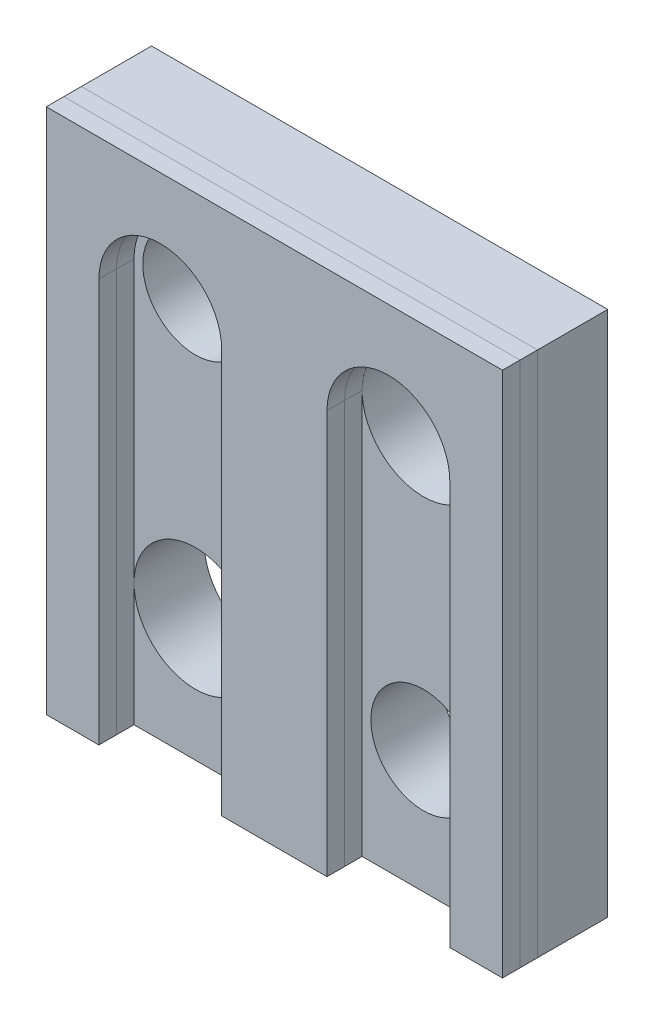
ISO-10303-21;
HEADER;
FILE_DESCRIPTION(('STEP AP214'),'2;1');
FILE_NAME('part.step','',(''),(''),'','','');
FILE_SCHEMA(('AUTOMOTIVE_DESIGN { 1 0 10303 214 1 1 1 1 }'));
ENDSEC;
DATA;
#1=APPLICATION_CONTEXT('core data for automotive mechanical design processes');
#2=APPLICATION_PROTOCOL_DEFINITION('international standard','automotive_design',2000,#1);
#3=PRODUCT_CONTEXT('',#1,'mechanical');
#4=PRODUCT('Part','Part','',(#3));
#5=PRODUCT_RELATED_PRODUCT_CATEGORY('part','',(#4));
#6=PRODUCT_DEFINITION_FORMATION('','',#4);
#7=PRODUCT_DEFINITION_CONTEXT('part definition',#1,'design');
#8=PRODUCT_DEFINITION('design','',#6,#7);
#9=PRODUCT_DEFINITION_SHAPE('','',#8);
#10=(LENGTH_UNIT() NAMED_UNIT(*) SI_UNIT(.MILLI.,.METRE.));
#11=(NAMED_UNIT(*) PLANE_ANGLE_UNIT() SI_UNIT($,.RADIAN.));
#12=(NAMED_UNIT(*) SI_UNIT($,.STERADIAN.) SOLID_ANGLE_UNIT());
#13=UNCERTAINTY_MEASURE_WITH_UNIT(LENGTH_MEASURE(1.E-05),#10,'distance_accuracy_value','');
#14=(GEOMETRIC_REPRESENTATION_CONTEXT(3) GLOBAL_UNCERTAINTY_ASSIGNED_CONTEXT((#13)) GLOBAL_UNIT_ASSIGNED_CONTEXT((#10,
#11,#12)) REPRESENTATION_CONTEXT('',''));
#15=CARTESIAN_POINT('',(0.,0.,0.));
#16=DIRECTION('',(0.,0.,1.));
#17=DIRECTION('',(1.,0.,0.));
#18=AXIS2_PLACEMENT_3D('',#15,#16,#17);
#19=CARTESIAN_POINT('',(-13.,-15.01,5.));
#20=DIRECTION('',(0.,0.,1.));
#21=DIRECTION('',(1.,0.,0.));
#22=AXIS2_PLACEMENT_3D('',#19,#20,#21);
#23=PLANE('',#22);
#24=DIRECTION('',(0.,-1.,0.));
#25=VECTOR('',#24,1.);
#26=CARTESIAN_POINT('',(10.,8.,5.));
#27=LINE('',#26,#25);
#28=CARTESIAN_POINT('',(10.,8.,5.));
#29=VERTEX_POINT('',#28);
#30=CARTESIAN_POINT('',(9.99999999999999,-15.,5.));
#31=VERTEX_POINT('',#30);
#32=EDGE_CURVE('E137',#29,#31,#27,.T.);
#33=ORIENTED_EDGE('',*,*,#32,.T.);
#34=DIRECTION('',(1.,0.,0.));
#35=VECTOR('',#34,1.);
#36=CARTESIAN_POINT('',(9.99999999999999,-15.,5.));
#37=LINE('',#36,#35);
#38=CARTESIAN_POINT('',(13.,-15.,5.));
#39=VERTEX_POINT('',#38);
#40=EDGE_CURVE('E144',#31,#39,#37,.T.);
#41=ORIENTED_EDGE('',*,*,#40,.T.);
#42=DIRECTION('',(0.,1.,0.));
#43=VECTOR('',#42,1.);
#44=CARTESIAN_POINT('',(13.,-15.,5.));
#45=LINE('',#44,#43);
#46=CARTESIAN_POINT('',(13.,15.,5.));
#47=VERTEX_POINT('',#46);
#48=EDGE_CURVE('E148',#39,#47,#45,.T.);
#49=ORIENTED_EDGE('',*,*,#48,.T.);
#50=DIRECTION('',(-1.,0.,0.));
#51=VECTOR('',#50,1.);
#52=CARTESIAN_POINT('',(13.,15.,5.));
#53=LINE('',#52,#51);
#54=CARTESIAN_POINT('',(-13.,15.,5.));
#55=VERTEX_POINT('',#54);
#56=EDGE_CURVE('E212',#47,#55,#53,.T.);
#57=ORIENTED_EDGE('',*,*,#56,.T.);
#58=DIRECTION('',(0.,-1.,0.));
#59=VECTOR('',#58,1.);
#60=CARTESIAN_POINT('',(-13.,15.,5.));
#61=LINE('',#60,#59);
#62=CARTESIAN_POINT('',(-13.,-15.,5.));
#63=VERTEX_POINT('',#62);
#64=EDGE_CURVE('E215',#55,#63,#61,.T.);
#65=ORIENTED_EDGE('',*,*,#64,.T.);
#66=DIRECTION('',(1.,0.,0.));
#67=VECTOR('',#66,1.);
#68=CARTESIAN_POINT('',(-13.,-15.,5.));
#69=LINE('',#68,#67);
#70=CARTESIAN_POINT('',(-9.99999999999999,-15.,5.));
#71=VERTEX_POINT('',#70);
#72=EDGE_CURVE('E218',#63,#71,#69,.T.);
#73=ORIENTED_EDGE('',*,*,#72,.T.);
#74=DIRECTION('',(0.,1.,0.));
#75=VECTOR('',#74,1.);
#76=CARTESIAN_POINT('',(-9.99999999999999,8.,5.));
#77=LINE('',#76,#75);
#78=CARTESIAN_POINT('',(-9.99999999999999,8.,5.));
#79=VERTEX_POINT('',#78);
#80=EDGE_CURVE('E221',#71,#79,#77,.T.);
#81=ORIENTED_EDGE('',*,*,#80,.T.);
#82=CARTESIAN_POINT('',(-6.5,8.,5.));
#83=DIRECTION('',(0.,0.,1.));
#84=DIRECTION('',(1.,0.,0.));
#85=AXIS2_PLACEMENT_3D('',#82,#83,#84);
#86=CIRCLE('',#85,3.5);
#87=CARTESIAN_POINT('',(-3.,8.,5.));
#88=VERTEX_POINT('',#87);
#89=EDGE_CURVE('E224',#79,#88,#86,.F.);
#90=ORIENTED_EDGE('',*,*,#89,.T.);
#91=DIRECTION('',(0.,-1.,0.));
#92=VECTOR('',#91,1.);
#93=CARTESIAN_POINT('',(-3.,8.,5.));
#94=LINE('',#93,#92);
#95=CARTESIAN_POINT('',(-3.,-15.,5.));
#96=VERTEX_POINT('',#95);
#97=EDGE_CURVE('E227',#88,#96,#94,.T.);
#98=ORIENTED_EDGE('',*,*,#97,.T.);
#99=DIRECTION('',(1.,0.,0.));
#100=VECTOR('',#99,1.);
#101=CARTESIAN_POINT('',(-3.,-15.,5.));
#102=LINE('',#101,#100);
#103=CARTESIAN_POINT('',(2.99999999999999,-15.,5.));
#104=VERTEX_POINT('',#103);
#105=EDGE_CURVE('E230',#96,#104,#102,.T.);
#106=ORIENTED_EDGE('',*,*,#105,.T.);
#107=DIRECTION('',(0.,1.,0.));
#108=VECTOR('',#107,1.);
#109=CARTESIAN_POINT('',(3.,8.,5.));
#110=LINE('',#109,#108);
#111=CARTESIAN_POINT('',(3.,8.,5.));
#112=VERTEX_POINT('',#111);
#113=EDGE_CURVE('E155',#104,#112,#110,.T.);
#114=ORIENTED_EDGE('',*,*,#113,.T.);
#115=CARTESIAN_POINT('',(6.5,8.,5.));
#116=DIRECTION('',(0.,0.,1.));
#117=DIRECTION('',(1.,0.,0.));
#118=AXIS2_PLACEMENT_3D('',#115,#116,#117);
#119=CIRCLE('',#118,3.5);
#120=EDGE_CURVE('E153',#112,#29,#119,.F.);
#121=ORIENTED_EDGE('',*,*,#120,.T.);
#122=EDGE_LOOP('',(#33,#41,#49,#57,#65,#73,#81,#90,#98,#106,#114,#121));
#123=FACE_BOUND('',#122,.T.);
#124=ADVANCED_FACE('F43',(#123),#23,.T.);
#125=CARTESIAN_POINT('',(9.99999999999999,-15.,6.));
#126=DIRECTION('',(0.,1.,0.));
#127=DIRECTION('',(-1.,0.,0.));
#128=AXIS2_PLACEMENT_3D('',#125,#126,#127);
#129=PLANE('',#128);
#130=ORIENTED_EDGE('',*,*,#40,.F.);
#131=DIRECTION('',(0.,0.,-1.));
#132=VECTOR('',#131,1.);
#133=CARTESIAN_POINT('',(9.99999999999999,-15.,6.));
#134=LINE('',#133,#132);
#135=CARTESIAN_POINT('',(9.99999999999999,-15.,4.));
#136=VERTEX_POINT('',#135);
#137=EDGE_CURVE('E47',#31,#136,#134,.T.);
#138=ORIENTED_EDGE('',*,*,#137,.T.);
#139=DIRECTION('',(1.,0.,0.));
#140=VECTOR('',#139,1.);
#141=CARTESIAN_POINT('',(9.99999999999999,-15.,4.));
#142=LINE('',#141,#140);
#143=CARTESIAN_POINT('',(13.,-15.,4.));
#144=VERTEX_POINT('',#143);
#145=EDGE_CURVE('E12',#136,#144,#142,.T.);
#146=ORIENTED_EDGE('',*,*,#145,.T.);
#147=DIRECTION('',(0.,0.,-1.));
#148=VECTOR('',#147,1.);
#149=CARTESIAN_POINT('',(13.,-15.,6.));
#150=LINE('',#149,#148);
#151=EDGE_CURVE('E60',#39,#144,#150,.T.);
#152=ORIENTED_EDGE('',*,*,#151,.F.);
#153=EDGE_LOOP('',(#130,#138,#146,#152));
#154=FACE_BOUND('',#153,.T.);
#155=ADVANCED_FACE('F145',(#154),#129,.F.);
#156=CARTESIAN_POINT('',(13.,-15.,6.));
#157=DIRECTION('',(-1.,0.,0.));
#158=DIRECTION('',(0.,0.,1.));
#159=AXIS2_PLACEMENT_3D('',#156,#157,#158);
#160=PLANE('',#159);
#161=ORIENTED_EDGE('',*,*,#48,.F.);
#162=ORIENTED_EDGE('',*,*,#151,.T.);
#163=DIRECTION('',(0.,1.,0.));
#164=VECTOR('',#163,1.);
#165=CARTESIAN_POINT('',(13.,-15.,4.));
#166=LINE('',#165,#164);
#167=CARTESIAN_POINT('',(13.,15.,4.));
#168=VERTEX_POINT('',#167);
#169=EDGE_CURVE('E52',#144,#168,#166,.T.);
#170=ORIENTED_EDGE('',*,*,#169,.T.);
#171=DIRECTION('',(0.,0.,-1.));
#172=VECTOR('',#171,1.);
#173=CARTESIAN_POINT('',(13.,15.,6.));
#174=LINE('',#173,#172);
#175=EDGE_CURVE('E68',#47,#168,#174,.T.);
#176=ORIENTED_EDGE('',*,*,#175,.F.);
#177=EDGE_LOOP('',(#161,#162,#170,#176));
#178=FACE_BOUND('',#177,.T.);
#179=ADVANCED_FACE('F261',(#178),#160,.F.);
#180=CARTESIAN_POINT('',(13.,15.,6.));
#181=DIRECTION('',(0.,-1.,0.));
#182=DIRECTION('',(0.,0.,-1.));
#183=AXIS2_PLACEMENT_3D('',#180,#181,#182);
#184=PLANE('',#183);
#185=ORIENTED_EDGE('',*,*,#56,.F.);
#186=ORIENTED_EDGE('',*,*,#175,.T.);
#187=DIRECTION('',(-1.,0.,0.));
#188=VECTOR('',#187,1.);
#189=CARTESIAN_POINT('',(13.,15.,4.));
#190=LINE('',#189,#188);
#191=CARTESIAN_POINT('',(-13.,15.,4.));
#192=VERTEX_POINT('',#191);
#193=EDGE_CURVE('E208',#168,#192,#190,.T.);
#194=ORIENTED_EDGE('',*,*,#193,.T.);
#195=DIRECTION('',(0.,0.,-1.));
#196=VECTOR('',#195,1.);
#197=CARTESIAN_POINT('',(-13.,15.,6.));
#198=LINE('',#197,#196);
#199=EDGE_CURVE('E161',#55,#192,#198,.T.);
#200=ORIENTED_EDGE('',*,*,#199,.F.);
#201=EDGE_LOOP('',(#185,#186,#194,#200));
#202=FACE_BOUND('',#201,.T.);
#203=ADVANCED_FACE('F260',(#202),#184,.F.);
#204=CARTESIAN_POINT('',(-13.,15.,6.));
#205=DIRECTION('',(1.,0.,0.));
#206=DIRECTION('',(0.,0.,-1.));
#207=AXIS2_PLACEMENT_3D('',#204,#205,#206);
#208=PLANE('',#207);
#209=ORIENTED_EDGE('',*,*,#64,.F.);
#210=ORIENTED_EDGE('',*,*,#199,.T.);
#211=DIRECTION('',(0.,-1.,0.));
#212=VECTOR('',#211,1.);
#213=CARTESIAN_POINT('',(-13.,15.,4.));
#214=LINE('',#213,#212);
#215=CARTESIAN_POINT('',(-13.,-15.,4.));
#216=VERTEX_POINT('',#215);
#217=EDGE_CURVE('E205',#192,#216,#214,.T.);
#218=ORIENTED_EDGE('',*,*,#217,.T.);
#219=DIRECTION('',(0.,0.,-1.));
#220=VECTOR('',#219,1.);
#221=CARTESIAN_POINT('',(-13.,-15.,6.));
#222=LINE('',#221,#220);
#223=EDGE_CURVE('E163',#63,#216,#222,.T.);
#224=ORIENTED_EDGE('',*,*,#223,.F.);
#225=EDGE_LOOP('',(#209,#210,#218,#224));
#226=FACE_BOUND('',#225,.T.);
#227=ADVANCED_FACE('F258',(#226),#208,.F.);
#228=CARTESIAN_POINT('',(-13.,-15.,6.));
#229=DIRECTION('',(0.,1.,0.));
#230=DIRECTION('',(-1.,0.,0.));
#231=AXIS2_PLACEMENT_3D('',#228,#229,#230);
#232=PLANE('',#231);
#233=ORIENTED_EDGE('',*,*,#72,.F.);
#234=ORIENTED_EDGE('',*,*,#223,.T.);
#235=DIRECTION('',(1.,0.,0.));
#236=VECTOR('',#235,1.);
#237=CARTESIAN_POINT('',(-13.,-15.,4.));
#238=LINE('',#237,#236);
#239=CARTESIAN_POINT('',(-9.99999999999999,-15.,4.));
#240=VERTEX_POINT('',#239);
#241=EDGE_CURVE('E202',#216,#240,#238,.T.);
#242=ORIENTED_EDGE('',*,*,#241,.T.);
#243=DIRECTION('',(0.,0.,-1.));
#244=VECTOR('',#243,1.);
#245=CARTESIAN_POINT('',(-9.99999999999999,-15.,6.));
#246=LINE('',#245,#244);
#247=EDGE_CURVE('E165',#71,#240,#246,.T.);
#248=ORIENTED_EDGE('',*,*,#247,.F.);
#249=EDGE_LOOP('',(#233,#234,#242,#248));
#250=FACE_BOUND('',#249,.T.);
#251=ADVANCED_FACE('F255',(#250),#232,.F.);
#252=CARTESIAN_POINT('',(-9.99999999999999,8.,6.));
#253=DIRECTION('',(-1.,0.,0.));
#254=DIRECTION('',(0.,0.,1.));
#255=AXIS2_PLACEMENT_3D('',#252,#253,#254);
#256=PLANE('',#255);
#257=ORIENTED_EDGE('',*,*,#80,.F.);
#258=ORIENTED_EDGE('',*,*,#247,.T.);
#259=DIRECTION('',(0.,1.,0.));
#260=VECTOR('',#259,1.);
#261=CARTESIAN_POINT('',(-9.99999999999999,8.,4.));
#262=LINE('',#261,#260);
#263=CARTESIAN_POINT('',(-9.99999999999999,8.,4.));
#264=VERTEX_POINT('',#263);
#265=EDGE_CURVE('E199',#240,#264,#262,.T.);
#266=ORIENTED_EDGE('',*,*,#265,.T.);
#267=DIRECTION('',(0.,0.,-1.));
#268=VECTOR('',#267,1.);
#269=CARTESIAN_POINT('',(-9.99999999999999,8.,6.));
#270=LINE('',#269,#268);
#271=EDGE_CURVE('E167',#79,#264,#270,.T.);
#272=ORIENTED_EDGE('',*,*,#271,.F.);
#273=EDGE_LOOP('',(#257,#258,#266,#272));
#274=FACE_BOUND('',#273,.T.);
#275=ADVANCED_FACE('F252',(#274),#256,.F.);
#276=CARTESIAN_POINT('',(-6.5,8.,6.));
#277=DIRECTION('',(0.,0.,-1.));
#278=DIRECTION('',(-1.,0.,0.));
#279=AXIS2_PLACEMENT_3D('',#276,#277,#278);
#280=CYLINDRICAL_SURFACE('',#279,3.5);
#281=ORIENTED_EDGE('',*,*,#89,.F.);
#282=ORIENTED_EDGE('',*,*,#271,.T.);
#283=CARTESIAN_POINT('',(-6.5,8.,4.));
#284=DIRECTION('',(0.,0.,-1.));
#285=DIRECTION('',(1.,0.,0.));
#286=AXIS2_PLACEMENT_3D('',#283,#284,#285);
#287=CIRCLE('',#286,3.5);
#288=CARTESIAN_POINT('',(-3.,8.,4.));
#289=VERTEX_POINT('',#288);
#290=EDGE_CURVE('E196',#264,#289,#287,.T.);
#291=ORIENTED_EDGE('',*,*,#290,.T.);
#292=DIRECTION('',(0.,0.,-1.));
#293=VECTOR('',#292,1.);
#294=CARTESIAN_POINT('',(-3.,8.,6.));
#295=LINE('',#294,#293);
#296=EDGE_CURVE('E169',#88,#289,#295,.T.);
#297=ORIENTED_EDGE('',*,*,#296,.F.);
#298=EDGE_LOOP('',(#281,#282,#291,#297));
#299=FACE_BOUND('',#298,.T.);
#300=ADVANCED_FACE('F246',(#299),#280,.F.);
#301=CARTESIAN_POINT('',(-3.,8.,6.));
#302=DIRECTION('',(1.,0.,0.));
#303=DIRECTION('',(0.,1.,0.));
#304=AXIS2_PLACEMENT_3D('',#301,#302,#303);
#305=PLANE('',#304);
#306=ORIENTED_EDGE('',*,*,#97,.F.);
#307=ORIENTED_EDGE('',*,*,#296,.T.);
#308=DIRECTION('',(0.,-1.,0.));
#309=VECTOR('',#308,1.);
#310=CARTESIAN_POINT('',(-3.,8.,4.));
#311=LINE('',#310,#309);
#312=CARTESIAN_POINT('',(-3.,-15.,4.));
#313=VERTEX_POINT('',#312);
#314=EDGE_CURVE('E193',#289,#313,#311,.T.);
#315=ORIENTED_EDGE('',*,*,#314,.T.);
#316=DIRECTION('',(0.,0.,-1.));
#317=VECTOR('',#316,1.);
#318=CARTESIAN_POINT('',(-3.,-15.,6.));
#319=LINE('',#318,#317);
#320=EDGE_CURVE('E171',#96,#313,#319,.T.);
#321=ORIENTED_EDGE('',*,*,#320,.F.);
#322=EDGE_LOOP('',(#306,#307,#315,#321));
#323=FACE_BOUND('',#322,.T.);
#324=ADVANCED_FACE('F243',(#323),#305,.F.);
#325=CARTESIAN_POINT('',(-3.,-15.,6.));
#326=DIRECTION('',(0.,1.,0.));
#327=DIRECTION('',(0.,0.,1.));
#328=AXIS2_PLACEMENT_3D('',#325,#326,#327);
#329=PLANE('',#328);
#330=ORIENTED_EDGE('',*,*,#105,.F.);
#331=ORIENTED_EDGE('',*,*,#320,.T.);
#332=DIRECTION('',(1.,0.,0.));
#333=VECTOR('',#332,1.);
#334=CARTESIAN_POINT('',(-3.,-15.,4.));
#335=LINE('',#334,#333);
#336=CARTESIAN_POINT('',(2.99999999999999,-15.,4.));
#337=VERTEX_POINT('',#336);
#338=EDGE_CURVE('E190',#313,#337,#335,.T.);
#339=ORIENTED_EDGE('',*,*,#338,.T.);
#340=DIRECTION('',(0.,0.,-1.));
#341=VECTOR('',#340,1.);
#342=CARTESIAN_POINT('',(2.99999999999999,-15.,6.));
#343=LINE('',#342,#341);
#344=EDGE_CURVE('E173',#104,#337,#343,.T.);
#345=ORIENTED_EDGE('',*,*,#344,.F.);
#346=EDGE_LOOP('',(#330,#331,#339,#345));
#347=FACE_BOUND('',#346,.T.);
#348=ADVANCED_FACE('F240',(#347),#329,.F.);
#349=CARTESIAN_POINT('',(3.,8.,6.));
#350=DIRECTION('',(-1.,0.,0.));
#351=DIRECTION('',(0.,-1.,0.));
#352=AXIS2_PLACEMENT_3D('',#349,#350,#351);
#353=PLANE('',#352);
#354=ORIENTED_EDGE('',*,*,#113,.F.);
#355=ORIENTED_EDGE('',*,*,#344,.T.);
#356=DIRECTION('',(0.,1.,0.));
#357=VECTOR('',#356,1.);
#358=CARTESIAN_POINT('',(3.,8.,4.));
#359=LINE('',#358,#357);
#360=CARTESIAN_POINT('',(3.,8.,4.));
#361=VERTEX_POINT('',#360);
#362=EDGE_CURVE('E184',#337,#361,#359,.T.);
#363=ORIENTED_EDGE('',*,*,#362,.T.);
#364=DIRECTION('',(0.,0.,-1.));
#365=VECTOR('',#364,1.);
#366=CARTESIAN_POINT('',(3.,8.,6.));
#367=LINE('',#366,#365);
#368=EDGE_CURVE('E175',#112,#361,#367,.T.);
#369=ORIENTED_EDGE('',*,*,#368,.F.);
#370=EDGE_LOOP('',(#354,#355,#363,#369));
#371=FACE_BOUND('',#370,.T.);
#372=ADVANCED_FACE('F235',(#371),#353,.F.);
#373=CARTESIAN_POINT('',(6.5,8.,6.));
#374=DIRECTION('',(0.,0.,-1.));
#375=DIRECTION('',(-1.,0.,0.));
#376=AXIS2_PLACEMENT_3D('',#373,#374,#375);
#377=CYLINDRICAL_SURFACE('',#376,3.5);
#378=ORIENTED_EDGE('',*,*,#120,.F.);
#379=ORIENTED_EDGE('',*,*,#368,.T.);
#380=CARTESIAN_POINT('',(6.5,8.,4.));
#381=DIRECTION('',(0.,0.,-1.));
#382=DIRECTION('',(1.,0.,0.));
#383=AXIS2_PLACEMENT_3D('',#380,#381,#382);
#384=CIRCLE('',#383,3.5);
#385=CARTESIAN_POINT('',(10.,8.,4.));
#386=VERTEX_POINT('',#385);
#387=EDGE_CURVE('E179',#361,#386,#384,.T.);
#388=ORIENTED_EDGE('',*,*,#387,.T.);
#389=DIRECTION('',(0.,0.,-1.));
#390=VECTOR('',#389,1.);
#391=CARTESIAN_POINT('',(10.,8.,6.));
#392=LINE('',#391,#390);
#393=EDGE_CURVE('E142',#29,#386,#392,.T.);
#394=ORIENTED_EDGE('',*,*,#393,.F.);
#395=EDGE_LOOP('',(#378,#379,#388,#394));
#396=FACE_BOUND('',#395,.T.);
#397=ADVANCED_FACE('F180',(#396),#377,.F.);
#398=CARTESIAN_POINT('',(10.,8.,6.));
#399=DIRECTION('',(1.,0.,0.));
#400=DIRECTION('',(0.,1.,0.));
#401=AXIS2_PLACEMENT_3D('',#398,#399,#400);
#402=PLANE('',#401);
#403=ORIENTED_EDGE('',*,*,#32,.F.);
#404=ORIENTED_EDGE('',*,*,#393,.T.);
#405=DIRECTION('',(0.,-1.,0.));
#406=VECTOR('',#405,1.);
#407=CARTESIAN_POINT('',(10.,8.,4.));
#408=LINE('',#407,#406);
#409=EDGE_CURVE('E139',#386,#136,#408,.T.);
#410=ORIENTED_EDGE('',*,*,#409,.T.);
#411=ORIENTED_EDGE('',*,*,#137,.F.);
#412=EDGE_LOOP('',(#403,#404,#410,#411));
#413=FACE_BOUND('',#412,.T.);
#414=ADVANCED_FACE('F45',(#413),#402,.F.);
#415=CARTESIAN_POINT('',(-6.5,8.,4.));
#416=DIRECTION('',(0.,0.,1.));
#417=DIRECTION('',(1.,0.,0.));
#418=AXIS2_PLACEMENT_3D('',#415,#416,#417);
#419=PLANE('',#418);
#420=ORIENTED_EDGE('',*,*,#145,.F.);
#421=ORIENTED_EDGE('',*,*,#409,.F.);
#422=ORIENTED_EDGE('',*,*,#387,.F.);
#423=ORIENTED_EDGE('',*,*,#362,.F.);
#424=ORIENTED_EDGE('',*,*,#338,.F.);
#425=ORIENTED_EDGE('',*,*,#314,.F.);
#426=ORIENTED_EDGE('',*,*,#290,.F.);
#427=ORIENTED_EDGE('',*,*,#265,.F.);
#428=ORIENTED_EDGE('',*,*,#241,.F.);
#429=ORIENTED_EDGE('',*,*,#217,.F.);
#430=ORIENTED_EDGE('',*,*,#193,.F.);
#431=ORIENTED_EDGE('',*,*,#169,.F.);
#432=EDGE_LOOP('',(#420,#421,#422,#423,#424,#425,#426,#427,#428,#429,#430,#431));
#433=FACE_BOUND('',#432,.T.);
#434=ADVANCED_FACE('F186',(#433),#419,.F.);
#435=CLOSED_SHELL('',(#124,#155,#179,#203,#227,#251,#275,#300,#324,#348,#372,#397,#414,#434));
#436=MANIFOLD_SOLID_BREP('B2',#435);
#437=CARTESIAN_POINT('',(-13.,-15.01,5.));
#438=DIRECTION('',(0.,0.,1.));
#439=DIRECTION('',(1.,0.,0.));
#440=AXIS2_PLACEMENT_3D('',#437,#438,#439);
#441=PLANE('',#440);
#442=DIRECTION('',(0.,-1.,0.));
#443=VECTOR('',#442,1.);
#444=CARTESIAN_POINT('',(10.,8.,5.));
#445=LINE('',#444,#443);
#446=CARTESIAN_POINT('',(10.,8.,5.));
#447=VERTEX_POINT('',#446);
#448=CARTESIAN_POINT('',(9.99999999999999,-15.,5.));
#449=VERTEX_POINT('',#448);
#450=EDGE_CURVE('E485',#447,#449,#445,.T.);
#451=ORIENTED_EDGE('',*,*,#450,.F.);
#452=CARTESIAN_POINT('',(6.5,8.,5.));
#453=DIRECTION('',(0.,0.,1.));
#454=DIRECTION('',(1.,0.,0.));
#455=AXIS2_PLACEMENT_3D('',#452,#453,#454);
#456=CIRCLE('',#455,3.5);
#457=CARTESIAN_POINT('',(3.,8.,5.));
#458=VERTEX_POINT('',#457);
#459=EDGE_CURVE('E488',#458,#447,#456,.F.);
#460=ORIENTED_EDGE('',*,*,#459,.F.);
#461=DIRECTION('',(0.,1.,0.));
#462=VECTOR('',#461,1.);
#463=CARTESIAN_POINT('',(3.,8.,5.));
#464=LINE('',#463,#462);
#465=CARTESIAN_POINT('',(2.99999999999999,-15.,5.));
#466=VERTEX_POINT('',#465);
#467=EDGE_CURVE('E501',#466,#458,#464,.T.);
#468=ORIENTED_EDGE('',*,*,#467,.F.);
#469=DIRECTION('',(1.,0.,0.));
#470=VECTOR('',#469,1.);
#471=CARTESIAN_POINT('',(-3.,-15.,5.));
#472=LINE('',#471,#470);
#473=CARTESIAN_POINT('',(-3.,-15.,5.));
#474=VERTEX_POINT('',#473);
#475=EDGE_CURVE('E503',#474,#466,#472,.T.);
#476=ORIENTED_EDGE('',*,*,#475,.F.);
#477=DIRECTION('',(0.,-1.,0.));
#478=VECTOR('',#477,1.);
#479=CARTESIAN_POINT('',(-3.,8.,5.));
#480=LINE('',#479,#478);
#481=CARTESIAN_POINT('',(-3.,8.,5.));
#482=VERTEX_POINT('',#481);
#483=EDGE_CURVE('E505',#482,#474,#480,.T.);
#484=ORIENTED_EDGE('',*,*,#483,.F.);
#485=CARTESIAN_POINT('',(-6.5,8.,5.));
#486=DIRECTION('',(0.,0.,1.));
#487=DIRECTION('',(1.,0.,0.));
#488=AXIS2_PLACEMENT_3D('',#485,#486,#487);
#489=CIRCLE('',#488,3.5);
#490=CARTESIAN_POINT('',(-9.99999999999999,8.,5.));
#491=VERTEX_POINT('',#490);
#492=EDGE_CURVE('E507',#491,#482,#489,.F.);
#493=ORIENTED_EDGE('',*,*,#492,.F.);
#494=DIRECTION('',(0.,1.,0.));
#495=VECTOR('',#494,1.);
#496=CARTESIAN_POINT('',(-9.99999999999999,8.,5.));
#497=LINE('',#496,#495);
#498=CARTESIAN_POINT('',(-9.99999999999999,-15.,5.));
#499=VERTEX_POINT('',#498);
#500=EDGE_CURVE('E509',#499,#491,#497,.T.);
#501=ORIENTED_EDGE('',*,*,#500,.F.);
#502=DIRECTION('',(1.,0.,0.));
#503=VECTOR('',#502,1.);
#504=CARTESIAN_POINT('',(-13.,-15.,5.));
#505=LINE('',#504,#503);
#506=CARTESIAN_POINT('',(-13.,-15.,5.));
#507=VERTEX_POINT('',#506);
#508=EDGE_CURVE('E497',#507,#499,#505,.T.);
#509=ORIENTED_EDGE('',*,*,#508,.F.);
#510=DIRECTION('',(0.,-1.,0.));
#511=VECTOR('',#510,1.);
#512=CARTESIAN_POINT('',(-13.,15.,5.));
#513=LINE('',#512,#511);
#514=CARTESIAN_POINT('',(-13.,15.,5.));
#515=VERTEX_POINT('',#514);
#516=EDGE_CURVE('E494',#515,#507,#513,.T.);
#517=ORIENTED_EDGE('',*,*,#516,.F.);
#518=DIRECTION('',(-1.,0.,0.));
#519=VECTOR('',#518,1.);
#520=CARTESIAN_POINT('',(13.,15.,5.));
#521=LINE('',#520,#519);
#522=CARTESIAN_POINT('',(13.,15.,5.));
#523=VERTEX_POINT('',#522);
#524=EDGE_CURVE('E496',#523,#515,#521,.T.);
#525=ORIENTED_EDGE('',*,*,#524,.F.);
#526=DIRECTION('',(0.,1.,0.));
#527=VECTOR('',#526,1.);
#528=CARTESIAN_POINT('',(13.,-15.,5.));
#529=LINE('',#528,#527);
#530=CARTESIAN_POINT('',(13.,-15.,5.));
#531=VERTEX_POINT('',#530);
#532=EDGE_CURVE('E390',#531,#523,#529,.T.);
#533=ORIENTED_EDGE('',*,*,#532,.F.);
#534=DIRECTION('',(1.,0.,0.));
#535=VECTOR('',#534,1.);
#536=CARTESIAN_POINT('',(9.99999999999999,-15.,5.));
#537=LINE('',#536,#535);
#538=EDGE_CURVE('E41',#449,#531,#537,.T.);
#539=ORIENTED_EDGE('',*,*,#538,.F.);
#540=EDGE_LOOP('',(#451,#460,#468,#476,#484,#493,#501,#509,#517,#525,#533,#539));
#541=FACE_BOUND('',#540,.T.);
#542=ADVANCED_FACE('F383',(#541),#441,.F.);
#543=CARTESIAN_POINT('',(13.,-15.,6.));
#544=DIRECTION('',(-1.,0.,0.));
#545=DIRECTION('',(0.,0.,1.));
#546=AXIS2_PLACEMENT_3D('',#543,#544,#545);
#547=PLANE('',#546);
#548=DIRECTION('',(0.,0.,-1.));
#549=VECTOR('',#548,1.);
#550=CARTESIAN_POINT('',(13.,-15.,6.));
#551=LINE('',#550,#549);
#552=CARTESIAN_POINT('',(13.,-15.,6.));
#553=VERTEX_POINT('',#552);
#554=EDGE_CURVE('E470',#553,#531,#551,.T.);
#555=ORIENTED_EDGE('',*,*,#554,.T.);
#556=ORIENTED_EDGE('',*,*,#532,.T.);
#557=DIRECTION('',(0.,0.,-1.));
#558=VECTOR('',#557,1.);
#559=CARTESIAN_POINT('',(13.,15.,6.));
#560=LINE('',#559,#558);
#561=CARTESIAN_POINT('',(13.,15.,6.));
#562=VERTEX_POINT('',#561);
#563=EDGE_CURVE('E472',#562,#523,#560,.T.);
#564=ORIENTED_EDGE('',*,*,#563,.F.);
#565=DIRECTION('',(0.,1.,0.));
#566=VECTOR('',#565,1.);
#567=CARTESIAN_POINT('',(13.,-15.,6.));
#568=LINE('',#567,#566);
#569=EDGE_CURVE('E467',#553,#562,#568,.T.);
#570=ORIENTED_EDGE('',*,*,#569,.F.);
#571=EDGE_LOOP('',(#555,#556,#564,#570));
#572=FACE_BOUND('',#571,.T.);
#573=ADVANCED_FACE('F469',(#572),#547,.F.);
#574=CARTESIAN_POINT('',(13.,15.,6.));
#575=DIRECTION('',(0.,-1.,0.));
#576=DIRECTION('',(0.,0.,-1.));
#577=AXIS2_PLACEMENT_3D('',#574,#575,#576);
#578=PLANE('',#577);
#579=ORIENTED_EDGE('',*,*,#563,.T.);
#580=ORIENTED_EDGE('',*,*,#524,.T.);
#581=DIRECTION('',(0.,0.,-1.));
#582=VECTOR('',#581,1.);
#583=CARTESIAN_POINT('',(-13.,15.,6.));
#584=LINE('',#583,#582);
#585=CARTESIAN_POINT('',(-13.,15.,6.));
#586=VERTEX_POINT('',#585);
#587=EDGE_CURVE('E490',#586,#515,#584,.T.);
#588=ORIENTED_EDGE('',*,*,#587,.F.);
#589=DIRECTION('',(-1.,0.,0.));
#590=VECTOR('',#589,1.);
#591=CARTESIAN_POINT('',(13.,15.,6.));
#592=LINE('',#591,#590);
#593=EDGE_CURVE('E475',#562,#586,#592,.T.);
#594=ORIENTED_EDGE('',*,*,#593,.F.);
#595=EDGE_LOOP('',(#579,#580,#588,#594));
#596=FACE_BOUND('',#595,.T.);
#597=ADVANCED_FACE('F545',(#596),#578,.F.);
#598=CARTESIAN_POINT('',(-13.,15.,6.));
#599=DIRECTION('',(1.,0.,0.));
#600=DIRECTION('',(0.,0.,-1.));
#601=AXIS2_PLACEMENT_3D('',#598,#599,#600);
#602=PLANE('',#601);
#603=ORIENTED_EDGE('',*,*,#587,.T.);
#604=ORIENTED_EDGE('',*,*,#516,.T.);
#605=DIRECTION('',(0.,0.,-1.));
#606=VECTOR('',#605,1.);
#607=CARTESIAN_POINT('',(-13.,-15.,6.));
#608=LINE('',#607,#606);
#609=CARTESIAN_POINT('',(-13.,-15.,6.));
#610=VERTEX_POINT('',#609);
#611=EDGE_CURVE('E521',#610,#507,#608,.T.);
#612=ORIENTED_EDGE('',*,*,#611,.F.);
#613=DIRECTION('',(0.,-1.,0.));
#614=VECTOR('',#613,1.);
#615=CARTESIAN_POINT('',(-13.,15.,6.));
#616=LINE('',#615,#614);
#617=EDGE_CURVE('E543',#586,#610,#616,.T.);
#618=ORIENTED_EDGE('',*,*,#617,.F.);
#619=EDGE_LOOP('',(#603,#604,#612,#618));
#620=FACE_BOUND('',#619,.T.);
#621=ADVANCED_FACE('F542',(#620),#602,.F.);
#622=CARTESIAN_POINT('',(-13.,-15.,6.));
#623=DIRECTION('',(0.,1.,0.));
#624=DIRECTION('',(-1.,0.,0.));
#625=AXIS2_PLACEMENT_3D('',#622,#623,#624);
#626=PLANE('',#625);
#627=ORIENTED_EDGE('',*,*,#611,.T.);
#628=ORIENTED_EDGE('',*,*,#508,.T.);
#629=DIRECTION('',(0.,0.,-1.));
#630=VECTOR('',#629,1.);
#631=CARTESIAN_POINT('',(-9.99999999999999,-15.,6.));
#632=LINE('',#631,#630);
#633=CARTESIAN_POINT('',(-9.99999999999999,-15.,6.));
#634=VERTEX_POINT('',#633);
#635=EDGE_CURVE('E518',#634,#499,#632,.T.);
#636=ORIENTED_EDGE('',*,*,#635,.F.);
#637=DIRECTION('',(1.,0.,0.));
#638=VECTOR('',#637,1.);
#639=CARTESIAN_POINT('',(-13.,-15.,6.));
#640=LINE('',#639,#638);
#641=EDGE_CURVE('E709',#610,#634,#640,.T.);
#642=ORIENTED_EDGE('',*,*,#641,.F.);
#643=EDGE_LOOP('',(#627,#628,#636,#642));
#644=FACE_BOUND('',#643,.T.);
#645=ADVANCED_FACE('F515',(#644),#626,.F.);
#646=CARTESIAN_POINT('',(-9.99999999999999,8.,6.));
#647=DIRECTION('',(-1.,0.,0.));
#648=DIRECTION('',(0.,0.,1.));
#649=AXIS2_PLACEMENT_3D('',#646,#647,#648);
#650=PLANE('',#649);
#651=ORIENTED_EDGE('',*,*,#635,.T.);
#652=ORIENTED_EDGE('',*,*,#500,.T.);
#653=DIRECTION('',(0.,0.,-1.));
#654=VECTOR('',#653,1.);
#655=CARTESIAN_POINT('',(-9.99999999999999,8.,6.));
#656=LINE('',#655,#654);
#657=CARTESIAN_POINT('',(-9.99999999999999,8.,6.));
#658=VERTEX_POINT('',#657);
#659=EDGE_CURVE('E532',#658,#491,#656,.T.);
#660=ORIENTED_EDGE('',*,*,#659,.F.);
#661=DIRECTION('',(0.,1.,0.));
#662=VECTOR('',#661,1.);
#663=CARTESIAN_POINT('',(-9.99999999999999,8.,6.));
#664=LINE('',#663,#662);
#665=EDGE_CURVE('E531',#634,#658,#664,.T.);
#666=ORIENTED_EDGE('',*,*,#665,.F.);
#667=EDGE_LOOP('',(#651,#652,#660,#666));
#668=FACE_BOUND('',#667,.T.);
#669=ADVANCED_FACE('F530',(#668),#650,.F.);
#670=CARTESIAN_POINT('',(-6.5,8.,6.));
#671=DIRECTION('',(0.,0.,-1.));
#672=DIRECTION('',(-1.,0.,0.));
#673=AXIS2_PLACEMENT_3D('',#670,#671,#672);
#674=CYLINDRICAL_SURFACE('',#673,3.5);
#675=ORIENTED_EDGE('',*,*,#659,.T.);
#676=ORIENTED_EDGE('',*,*,#492,.T.);
#677=DIRECTION('',(0.,0.,-1.));
#678=VECTOR('',#677,1.);
#679=CARTESIAN_POINT('',(-3.,8.,6.));
#680=LINE('',#679,#678);
#681=CARTESIAN_POINT('',(-3.,8.,6.));
#682=VERTEX_POINT('',#681);
#683=EDGE_CURVE('E535',#682,#482,#680,.T.);
#684=ORIENTED_EDGE('',*,*,#683,.F.);
#685=CARTESIAN_POINT('',(-6.5,8.,6.));
#686=DIRECTION('',(0.,0.,-1.));
#687=DIRECTION('',(1.,0.,0.));
#688=AXIS2_PLACEMENT_3D('',#685,#686,#687);
#689=CIRCLE('',#688,3.5);
#690=EDGE_CURVE('E578',#658,#682,#689,.T.);
#691=ORIENTED_EDGE('',*,*,#690,.F.);
#692=EDGE_LOOP('',(#675,#676,#684,#691));
#693=FACE_BOUND('',#692,.T.);
#694=ADVANCED_FACE('F577',(#693),#674,.F.);
#695=CARTESIAN_POINT('',(-3.,8.,6.));
#696=DIRECTION('',(1.,0.,0.));
#697=DIRECTION('',(0.,1.,0.));
#698=AXIS2_PLACEMENT_3D('',#695,#696,#697);
#699=PLANE('',#698);
#700=ORIENTED_EDGE('',*,*,#683,.T.);
#701=ORIENTED_EDGE('',*,*,#483,.T.);
#702=DIRECTION('',(0.,0.,-1.));
#703=VECTOR('',#702,1.);
#704=CARTESIAN_POINT('',(-3.,-15.,6.));
#705=LINE('',#704,#703);
#706=CARTESIAN_POINT('',(-3.,-15.,6.));
#707=VERTEX_POINT('',#706);
#708=EDGE_CURVE('E565',#707,#474,#705,.T.);
#709=ORIENTED_EDGE('',*,*,#708,.F.);
#710=DIRECTION('',(0.,-1.,0.));
#711=VECTOR('',#710,1.);
#712=CARTESIAN_POINT('',(-3.,8.,6.));
#713=LINE('',#712,#711);
#714=EDGE_CURVE('E574',#682,#707,#713,.T.);
#715=ORIENTED_EDGE('',*,*,#714,.F.);
#716=EDGE_LOOP('',(#700,#701,#709,#715));
#717=FACE_BOUND('',#716,.T.);
#718=ADVANCED_FACE('F571',(#717),#699,.F.);
#719=CARTESIAN_POINT('',(-3.,-15.,6.));
#720=DIRECTION('',(0.,1.,0.));
#721=DIRECTION('',(0.,0.,1.));
#722=AXIS2_PLACEMENT_3D('',#719,#720,#721);
#723=PLANE('',#722);
#724=ORIENTED_EDGE('',*,*,#708,.T.);
#725=ORIENTED_EDGE('',*,*,#475,.T.);
#726=DIRECTION('',(0.,0.,-1.));
#727=VECTOR('',#726,1.);
#728=CARTESIAN_POINT('',(2.99999999999999,-15.,6.));
#729=LINE('',#728,#727);
#730=CARTESIAN_POINT('',(2.99999999999999,-15.,6.));
#731=VERTEX_POINT('',#730);
#732=EDGE_CURVE('E562',#731,#466,#729,.T.);
#733=ORIENTED_EDGE('',*,*,#732,.F.);
#734=DIRECTION('',(1.,0.,0.));
#735=VECTOR('',#734,1.);
#736=CARTESIAN_POINT('',(-3.,-15.,6.));
#737=LINE('',#736,#735);
#738=EDGE_CURVE('E584',#707,#731,#737,.T.);
#739=ORIENTED_EDGE('',*,*,#738,.F.);
#740=EDGE_LOOP('',(#724,#725,#733,#739));
#741=FACE_BOUND('',#740,.T.);
#742=ADVANCED_FACE('F583',(#741),#723,.F.);
#743=CARTESIAN_POINT('',(3.,8.,6.));
#744=DIRECTION('',(-1.,0.,0.));
#745=DIRECTION('',(0.,-1.,0.));
#746=AXIS2_PLACEMENT_3D('',#743,#744,#745);
#747=PLANE('',#746);
#748=ORIENTED_EDGE('',*,*,#732,.T.);
#749=ORIENTED_EDGE('',*,*,#467,.T.);
#750=DIRECTION('',(0.,0.,-1.));
#751=VECTOR('',#750,1.);
#752=CARTESIAN_POINT('',(3.,8.,6.));
#753=LINE('',#752,#751);
#754=CARTESIAN_POINT('',(3.,8.,6.));
#755=VERTEX_POINT('',#754);
#756=EDGE_CURVE('E554',#755,#458,#753,.T.);
#757=ORIENTED_EDGE('',*,*,#756,.F.);
#758=DIRECTION('',(0.,1.,0.));
#759=VECTOR('',#758,1.);
#760=CARTESIAN_POINT('',(3.,8.,6.));
#761=LINE('',#760,#759);
#762=EDGE_CURVE('E586',#731,#755,#761,.T.);
#763=ORIENTED_EDGE('',*,*,#762,.F.);
#764=EDGE_LOOP('',(#748,#749,#757,#763));
#765=FACE_BOUND('',#764,.T.);
#766=ADVANCED_FACE('F596',(#765),#747,.F.);
#767=CARTESIAN_POINT('',(-6.5,8.,6.));
#768=DIRECTION('',(0.,0.,1.));
#769=DIRECTION('',(1.,0.,0.));
#770=AXIS2_PLACEMENT_3D('',#767,#768,#769);
#771=PLANE('',#770);
#772=DIRECTION('',(1.,0.,0.));
#773=VECTOR('',#772,1.);
#774=CARTESIAN_POINT('',(9.99999999999999,-15.,6.));
#775=LINE('',#774,#773);
#776=CARTESIAN_POINT('',(9.99999999999999,-15.,6.));
#777=VERTEX_POINT('',#776);
#778=EDGE_CURVE('E476',#777,#553,#775,.T.);
#779=ORIENTED_EDGE('',*,*,#778,.T.);
#780=ORIENTED_EDGE('',*,*,#569,.T.);
#781=ORIENTED_EDGE('',*,*,#593,.T.);
#782=ORIENTED_EDGE('',*,*,#617,.T.);
#783=ORIENTED_EDGE('',*,*,#641,.T.);
#784=ORIENTED_EDGE('',*,*,#665,.T.);
#785=ORIENTED_EDGE('',*,*,#690,.T.);
#786=ORIENTED_EDGE('',*,*,#714,.T.);
#787=ORIENTED_EDGE('',*,*,#738,.T.);
#788=ORIENTED_EDGE('',*,*,#762,.T.);
#789=CARTESIAN_POINT('',(6.5,8.,6.));
#790=DIRECTION('',(0.,0.,-1.));
#791=DIRECTION('',(1.,0.,0.));
#792=AXIS2_PLACEMENT_3D('',#789,#790,#791);
#793=CIRCLE('',#792,3.5);
#794=CARTESIAN_POINT('',(10.,8.,6.));
#795=VERTEX_POINT('',#794);
#796=EDGE_CURVE('E556',#755,#795,#793,.T.);
#797=ORIENTED_EDGE('',*,*,#796,.T.);
#798=DIRECTION('',(0.,-1.,0.));
#799=VECTOR('',#798,1.);
#800=CARTESIAN_POINT('',(10.,8.,6.));
#801=LINE('',#800,#799);
#802=EDGE_CURVE('E481',#795,#777,#801,.T.);
#803=ORIENTED_EDGE('',*,*,#802,.T.);
#804=EDGE_LOOP('',(#779,#780,#781,#782,#783,#784,#785,#786,#787,#788,#797,#803));
#805=FACE_BOUND('',#804,.T.);
#806=ADVANCED_FACE('F479',(#805),#771,.T.);
#807=CARTESIAN_POINT('',(9.99999999999999,-15.,6.));
#808=DIRECTION('',(0.,1.,0.));
#809=DIRECTION('',(-1.,0.,0.));
#810=AXIS2_PLACEMENT_3D('',#807,#808,#809);
#811=PLANE('',#810);
#812=DIRECTION('',(0.,0.,-1.));
#813=VECTOR('',#812,1.);
#814=CARTESIAN_POINT('',(9.99999999999999,-15.,6.));
#815=LINE('',#814,#813);
#816=EDGE_CURVE('E550',#777,#449,#815,.T.);
#817=ORIENTED_EDGE('',*,*,#816,.T.);
#818=ORIENTED_EDGE('',*,*,#538,.T.);
#819=ORIENTED_EDGE('',*,*,#554,.F.);
#820=ORIENTED_EDGE('',*,*,#778,.F.);
#821=EDGE_LOOP('',(#817,#818,#819,#820));
#822=FACE_BOUND('',#821,.T.);
#823=ADVANCED_FACE('F484',(#822),#811,.F.);
#824=CARTESIAN_POINT('',(6.5,8.,6.));
#825=DIRECTION('',(0.,0.,-1.));
#826=DIRECTION('',(-1.,0.,0.));
#827=AXIS2_PLACEMENT_3D('',#824,#825,#826);
#828=CYLINDRICAL_SURFACE('',#827,3.5);
#829=ORIENTED_EDGE('',*,*,#756,.T.);
#830=ORIENTED_EDGE('',*,*,#459,.T.);
#831=DIRECTION('',(0.,0.,-1.));
#832=VECTOR('',#831,1.);
#833=CARTESIAN_POINT('',(10.,8.,6.));
#834=LINE('',#833,#832);
#835=EDGE_CURVE('E552',#795,#447,#834,.T.);
#836=ORIENTED_EDGE('',*,*,#835,.F.);
#837=ORIENTED_EDGE('',*,*,#796,.F.);
#838=EDGE_LOOP('',(#829,#830,#836,#837));
#839=FACE_BOUND('',#838,.T.);
#840=ADVANCED_FACE('F594',(#839),#828,.F.);
#841=CARTESIAN_POINT('',(10.,8.,6.));
#842=DIRECTION('',(1.,0.,0.));
#843=DIRECTION('',(0.,1.,0.));
#844=AXIS2_PLACEMENT_3D('',#841,#842,#843);
#845=PLANE('',#844);
#846=ORIENTED_EDGE('',*,*,#835,.T.);
#847=ORIENTED_EDGE('',*,*,#450,.T.);
#848=ORIENTED_EDGE('',*,*,#816,.F.);
#849=ORIENTED_EDGE('',*,*,#802,.F.);
#850=EDGE_LOOP('',(#846,#847,#848,#849));
#851=FACE_BOUND('',#850,.T.);
#852=ADVANCED_FACE('F549',(#851),#845,.F.);
#853=CLOSED_SHELL('',(#542,#573,#597,#621,#645,#669,#694,#718,#742,#766,#806,#823,#840,#852));
#854=MANIFOLD_SOLID_BREP('B6',#853);
#855=CARTESIAN_POINT('',(13.,-15.,4.));
#856=DIRECTION('',(-1.,0.,0.));
#857=DIRECTION('',(0.,0.,1.));
#858=AXIS2_PLACEMENT_3D('',#855,#856,#857);
#859=PLANE('',#858);
#860=DIRECTION('',(0.,1.,0.));
#861=VECTOR('',#860,1.);
#862=CARTESIAN_POINT('',(13.,-15.,0.));
#863=LINE('',#862,#861);
#864=CARTESIAN_POINT('',(13.,-15.,0.));
#865=VERTEX_POINT('',#864);
#866=CARTESIAN_POINT('',(13.,15.,0.));
#867=VERTEX_POINT('',#866);
#868=EDGE_CURVE('E777',#865,#867,#863,.T.);
#869=ORIENTED_EDGE('',*,*,#868,.T.);
#870=DIRECTION('',(0.,0.,-1.));
#871=VECTOR('',#870,1.);
#872=CARTESIAN_POINT('',(13.,15.,4.));
#873=LINE('',#872,#871);
#874=CARTESIAN_POINT('',(13.,15.,4.));
#875=VERTEX_POINT('',#874);
#876=EDGE_CURVE('E381',#875,#867,#873,.T.);
#877=ORIENTED_EDGE('',*,*,#876,.F.);
#878=DIRECTION('',(0.,1.,0.));
#879=VECTOR('',#878,1.);
#880=CARTESIAN_POINT('',(13.,-15.,4.));
#881=LINE('',#880,#879);
#882=CARTESIAN_POINT('',(13.,-15.,4.));
#883=VERTEX_POINT('',#882);
#884=EDGE_CURVE('E765',#883,#875,#881,.T.);
#885=ORIENTED_EDGE('',*,*,#884,.F.);
#886=DIRECTION('',(0.,0.,-1.));
#887=VECTOR('',#886,1.);
#888=CARTESIAN_POINT('',(13.,-15.,4.));
#889=LINE('',#888,#887);
#890=EDGE_CURVE('E773',#883,#865,#889,.T.);
#891=ORIENTED_EDGE('',*,*,#890,.T.);
#892=EDGE_LOOP('',(#869,#877,#885,#891));
#893=FACE_BOUND('',#892,.T.);
#894=ADVANCED_FACE('F714',(#893),#859,.F.);
#895=CARTESIAN_POINT('',(-13.,15.,4.));
#896=DIRECTION('',(0.,-1.,0.));
#897=DIRECTION('',(0.,0.,-1.));
#898=AXIS2_PLACEMENT_3D('',#895,#896,#897);
#899=PLANE('',#898);
#900=DIRECTION('',(-1.,0.,0.));
#901=VECTOR('',#900,1.);
#902=CARTESIAN_POINT('',(-13.,15.,0.));
#903=LINE('',#902,#901);
#904=CARTESIAN_POINT('',(-13.,15.,0.));
#905=VERTEX_POINT('',#904);
#906=EDGE_CURVE('E769',#867,#905,#903,.T.);
#907=ORIENTED_EDGE('',*,*,#906,.T.);
#908=DIRECTION('',(0.,0.,-1.));
#909=VECTOR('',#908,1.);
#910=CARTESIAN_POINT('',(-13.,15.,4.));
#911=LINE('',#910,#909);
#912=CARTESIAN_POINT('',(-13.,15.,4.));
#913=VERTEX_POINT('',#912);
#914=EDGE_CURVE('E722',#913,#905,#911,.T.);
#915=ORIENTED_EDGE('',*,*,#914,.F.);
#916=DIRECTION('',(-1.,0.,0.));
#917=VECTOR('',#916,1.);
#918=CARTESIAN_POINT('',(-13.,15.,4.));
#919=LINE('',#918,#917);
#920=EDGE_CURVE('E760',#875,#913,#919,.T.);
#921=ORIENTED_EDGE('',*,*,#920,.F.);
#922=ORIENTED_EDGE('',*,*,#876,.T.);
#923=EDGE_LOOP('',(#907,#915,#921,#922));
#924=FACE_BOUND('',#923,.T.);
#925=ADVANCED_FACE('F768',(#924),#899,.F.);
#926=CARTESIAN_POINT('',(-13.,-15.,4.));
#927=DIRECTION('',(1.,0.,0.));
#928=DIRECTION('',(0.,0.,-1.));
#929=AXIS2_PLACEMENT_3D('',#926,#927,#928);
#930=PLANE('',#929);
#931=DIRECTION('',(0.,-1.,0.));
#932=VECTOR('',#931,1.);
#933=CARTESIAN_POINT('',(-13.,-15.,0.));
#934=LINE('',#933,#932);
#935=CARTESIAN_POINT('',(-13.,-15.,0.));
#936=VERTEX_POINT('',#935);
#937=EDGE_CURVE('E747',#905,#936,#934,.T.);
#938=ORIENTED_EDGE('',*,*,#937,.T.);
#939=DIRECTION('',(0.,0.,-1.));
#940=VECTOR('',#939,1.);
#941=CARTESIAN_POINT('',(-13.,-15.,4.));
#942=LINE('',#941,#940);
#943=CARTESIAN_POINT('',(-13.,-15.,4.));
#944=VERTEX_POINT('',#943);
#945=EDGE_CURVE('E770',#944,#936,#942,.T.);
#946=ORIENTED_EDGE('',*,*,#945,.F.);
#947=DIRECTION('',(0.,-1.,0.));
#948=VECTOR('',#947,1.);
#949=CARTESIAN_POINT('',(-13.,-15.,4.));
#950=LINE('',#949,#948);
#951=EDGE_CURVE('E763',#913,#944,#950,.T.);
#952=ORIENTED_EDGE('',*,*,#951,.F.);
#953=ORIENTED_EDGE('',*,*,#914,.T.);
#954=EDGE_LOOP('',(#938,#946,#952,#953));
#955=FACE_BOUND('',#954,.T.);
#956=ADVANCED_FACE('F771',(#955),#930,.F.);
#957=CARTESIAN_POINT('',(-13.,-15.,4.));
#958=DIRECTION('',(0.,1.,0.));
#959=DIRECTION('',(0.,0.,1.));
#960=AXIS2_PLACEMENT_3D('',#957,#958,#959);
#961=PLANE('',#960);
#962=DIRECTION('',(1.,0.,0.));
#963=VECTOR('',#962,1.);
#964=CARTESIAN_POINT('',(-13.,-15.,0.));
#965=LINE('',#964,#963);
#966=EDGE_CURVE('E753',#936,#865,#965,.T.);
#967=ORIENTED_EDGE('',*,*,#966,.T.);
#968=ORIENTED_EDGE('',*,*,#890,.F.);
#969=DIRECTION('',(1.,0.,0.));
#970=VECTOR('',#969,1.);
#971=CARTESIAN_POINT('',(-13.,-15.,4.));
#972=LINE('',#971,#970);
#973=EDGE_CURVE('E730',#944,#883,#972,.T.);
#974=ORIENTED_EDGE('',*,*,#973,.F.);
#975=ORIENTED_EDGE('',*,*,#945,.T.);
#976=EDGE_LOOP('',(#967,#968,#974,#975));
#977=FACE_BOUND('',#976,.T.);
#978=ADVANCED_FACE('F785',(#977),#961,.F.);
#979=CARTESIAN_POINT('',(13.,15.,4.));
#980=DIRECTION('',(0.,0.,-1.));
#981=DIRECTION('',(-1.,0.,0.));
#982=AXIS2_PLACEMENT_3D('',#979,#980,#981);
#983=PLANE('',#982);
#984=CARTESIAN_POINT('',(6.5,-8.,4.));
#985=DIRECTION('',(0.,0.,1.));
#986=DIRECTION('',(1.,0.,0.));
#987=AXIS2_PLACEMENT_3D('',#984,#985,#986);
#988=CIRCLE('',#987,3.);
#989=CARTESIAN_POINT('',(9.5,-8.,4.));
#990=VERTEX_POINT('',#989);
#991=EDGE_CURVE('E809',#990,#990,#988,.T.);
#992=ORIENTED_EDGE('',*,*,#991,.F.);
#993=EDGE_LOOP('',(#992));
#994=FACE_BOUND('',#993,.T.);
#995=CARTESIAN_POINT('',(-6.5,-8.,4.));
#996=DIRECTION('',(0.,0.,1.));
#997=DIRECTION('',(1.,0.,0.));
#998=AXIS2_PLACEMENT_3D('',#995,#996,#997);
#999=CIRCLE('',#998,3.5);
#1000=CARTESIAN_POINT('',(-3.,-8.,4.));
#1001=VERTEX_POINT('',#1000);
#1002=EDGE_CURVE('E803',#1001,#1001,#999,.T.);
#1003=ORIENTED_EDGE('',*,*,#1002,.F.);
#1004=EDGE_LOOP('',(#1003));
#1005=FACE_BOUND('',#1004,.T.);
#1006=CARTESIAN_POINT('',(6.5,8.,4.));
#1007=DIRECTION('',(0.,0.,1.));
#1008=DIRECTION('',(1.,0.,0.));
#1009=AXIS2_PLACEMENT_3D('',#1006,#1007,#1008);
#1010=CIRCLE('',#1009,3.5);
#1011=CARTESIAN_POINT('',(10.,8.,4.));
#1012=VERTEX_POINT('',#1011);
#1013=EDGE_CURVE('E797',#1012,#1012,#1010,.T.);
#1014=ORIENTED_EDGE('',*,*,#1013,.F.);
#1015=EDGE_LOOP('',(#1014));
#1016=FACE_BOUND('',#1015,.T.);
#1017=CARTESIAN_POINT('',(-6.5,8.,4.));
#1018=DIRECTION('',(0.,0.,1.));
#1019=DIRECTION('',(1.,0.,0.));
#1020=AXIS2_PLACEMENT_3D('',#1017,#1018,#1019);
#1021=CIRCLE('',#1020,3.);
#1022=CARTESIAN_POINT('',(-3.5,8.,4.));
#1023=VERTEX_POINT('',#1022);
#1024=EDGE_CURVE('E791',#1023,#1023,#1021,.T.);
#1025=ORIENTED_EDGE('',*,*,#1024,.F.);
#1026=EDGE_LOOP('',(#1025));
#1027=FACE_BOUND('',#1026,.T.);
#1028=ORIENTED_EDGE('',*,*,#884,.T.);
#1029=ORIENTED_EDGE('',*,*,#920,.T.);
#1030=ORIENTED_EDGE('',*,*,#951,.T.);
#1031=ORIENTED_EDGE('',*,*,#973,.T.);
#1032=EDGE_LOOP('',(#1028,#1029,#1030,#1031));
#1033=FACE_BOUND('',#1032,.T.);
#1034=ADVANCED_FACE('F761',(#994,#1005,#1016,#1027,#1033),#983,.F.);
#1035=CARTESIAN_POINT('',(13.,15.,0.));
#1036=DIRECTION('',(0.,0.,-1.));
#1037=DIRECTION('',(-1.,0.,0.));
#1038=AXIS2_PLACEMENT_3D('',#1035,#1036,#1037);
#1039=PLANE('',#1038);
#1040=CARTESIAN_POINT('',(6.5,-8.,0.));
#1041=DIRECTION('',(0.,0.,1.));
#1042=DIRECTION('',(1.,0.,0.));
#1043=AXIS2_PLACEMENT_3D('',#1040,#1041,#1042);
#1044=CIRCLE('',#1043,3.);
#1045=CARTESIAN_POINT('',(9.5,-8.,0.));
#1046=VERTEX_POINT('',#1045);
#1047=EDGE_CURVE('E806',#1046,#1046,#1044,.T.);
#1048=ORIENTED_EDGE('',*,*,#1047,.T.);
#1049=EDGE_LOOP('',(#1048));
#1050=FACE_BOUND('',#1049,.T.);
#1051=CARTESIAN_POINT('',(-6.5,-8.,0.));
#1052=DIRECTION('',(0.,0.,1.));
#1053=DIRECTION('',(1.,0.,0.));
#1054=AXIS2_PLACEMENT_3D('',#1051,#1052,#1053);
#1055=CIRCLE('',#1054,3.5);
#1056=CARTESIAN_POINT('',(-3.,-8.,0.));
#1057=VERTEX_POINT('',#1056);
#1058=EDGE_CURVE('E800',#1057,#1057,#1055,.T.);
#1059=ORIENTED_EDGE('',*,*,#1058,.T.);
#1060=EDGE_LOOP('',(#1059));
#1061=FACE_BOUND('',#1060,.T.);
#1062=CARTESIAN_POINT('',(6.5,8.,0.));
#1063=DIRECTION('',(0.,0.,1.));
#1064=DIRECTION('',(1.,0.,0.));
#1065=AXIS2_PLACEMENT_3D('',#1062,#1063,#1064);
#1066=CIRCLE('',#1065,3.5);
#1067=CARTESIAN_POINT('',(10.,8.,0.));
#1068=VERTEX_POINT('',#1067);
#1069=EDGE_CURVE('E794',#1068,#1068,#1066,.T.);
#1070=ORIENTED_EDGE('',*,*,#1069,.T.);
#1071=EDGE_LOOP('',(#1070));
#1072=FACE_BOUND('',#1071,.T.);
#1073=CARTESIAN_POINT('',(-6.5,8.,0.));
#1074=DIRECTION('',(0.,0.,1.));
#1075=DIRECTION('',(1.,0.,0.));
#1076=AXIS2_PLACEMENT_3D('',#1073,#1074,#1075);
#1077=CIRCLE('',#1076,3.);
#1078=CARTESIAN_POINT('',(-3.5,8.,0.));
#1079=VERTEX_POINT('',#1078);
#1080=EDGE_CURVE('E780',#1079,#1079,#1077,.T.);
#1081=ORIENTED_EDGE('',*,*,#1080,.T.);
#1082=EDGE_LOOP('',(#1081));
#1083=FACE_BOUND('',#1082,.T.);
#1084=ORIENTED_EDGE('',*,*,#868,.F.);
#1085=ORIENTED_EDGE('',*,*,#966,.F.);
#1086=ORIENTED_EDGE('',*,*,#937,.F.);
#1087=ORIENTED_EDGE('',*,*,#906,.F.);
#1088=EDGE_LOOP('',(#1084,#1085,#1086,#1087));
#1089=FACE_BOUND('',#1088,.T.);
#1090=ADVANCED_FACE('F788',(#1050,#1061,#1072,#1083,#1089),#1039,.T.);
#1091=CARTESIAN_POINT('',(-6.5,8.,0.));
#1092=DIRECTION('',(0.,0.,1.));
#1093=DIRECTION('',(1.,0.,0.));
#1094=AXIS2_PLACEMENT_3D('',#1091,#1092,#1093);
#1095=CYLINDRICAL_SURFACE('',#1094,3.);
#1096=ORIENTED_EDGE('',*,*,#1080,.F.);
#1097=EDGE_LOOP('',(#1096));
#1098=FACE_BOUND('',#1097,.T.);
#1099=ORIENTED_EDGE('',*,*,#1024,.T.);
#1100=EDGE_LOOP('',(#1099));
#1101=FACE_BOUND('',#1100,.T.);
#1102=ADVANCED_FACE('F833',(#1098,#1101),#1095,.F.);
#1103=CARTESIAN_POINT('',(6.5,8.,0.));
#1104=DIRECTION('',(0.,0.,1.));
#1105=DIRECTION('',(1.,0.,0.));
#1106=AXIS2_PLACEMENT_3D('',#1103,#1104,#1105);
#1107=CYLINDRICAL_SURFACE('',#1106,3.5);
#1108=ORIENTED_EDGE('',*,*,#1069,.F.);
#1109=EDGE_LOOP('',(#1108));
#1110=FACE_BOUND('',#1109,.T.);
#1111=ORIENTED_EDGE('',*,*,#1013,.T.);
#1112=EDGE_LOOP('',(#1111));
#1113=FACE_BOUND('',#1112,.T.);
#1114=ADVANCED_FACE('F835',(#1110,#1113),#1107,.F.);
#1115=CARTESIAN_POINT('',(-6.5,-8.,0.));
#1116=DIRECTION('',(0.,0.,1.));
#1117=DIRECTION('',(1.,0.,0.));
#1118=AXIS2_PLACEMENT_3D('',#1115,#1116,#1117);
#1119=CYLINDRICAL_SURFACE('',#1118,3.5);
#1120=ORIENTED_EDGE('',*,*,#1058,.F.);
#1121=EDGE_LOOP('',(#1120));
#1122=FACE_BOUND('',#1121,.T.);
#1123=ORIENTED_EDGE('',*,*,#1002,.T.);
#1124=EDGE_LOOP('',(#1123));
#1125=FACE_BOUND('',#1124,.T.);
#1126=ADVANCED_FACE('F820',(#1122,#1125),#1119,.F.);
#1127=CARTESIAN_POINT('',(6.5,-8.,0.));
#1128=DIRECTION('',(0.,0.,1.));
#1129=DIRECTION('',(1.,0.,0.));
#1130=AXIS2_PLACEMENT_3D('',#1127,#1128,#1129);
#1131=CYLINDRICAL_SURFACE('',#1130,3.);
#1132=ORIENTED_EDGE('',*,*,#1047,.F.);
#1133=EDGE_LOOP('',(#1132));
#1134=FACE_BOUND('',#1133,.T.);
#1135=ORIENTED_EDGE('',*,*,#991,.T.);
#1136=EDGE_LOOP('',(#1135));
#1137=FACE_BOUND('',#1136,.T.);
#1138=ADVANCED_FACE('F817',(#1134,#1137),#1131,.F.);
#1139=CLOSED_SHELL('',(#894,#925,#956,#978,#1034,#1090,#1102,#1114,#1126,#1138));
#1140=MANIFOLD_SOLID_BREP('B35',#1139);
#1141=ADVANCED_BREP_SHAPE_REPRESENTATION('',(#18,#436,#854,#1140),#14);
#1142=SHAPE_DEFINITION_REPRESENTATION(#9,#1141);
ENDSEC;
END-ISO-10303-21;
